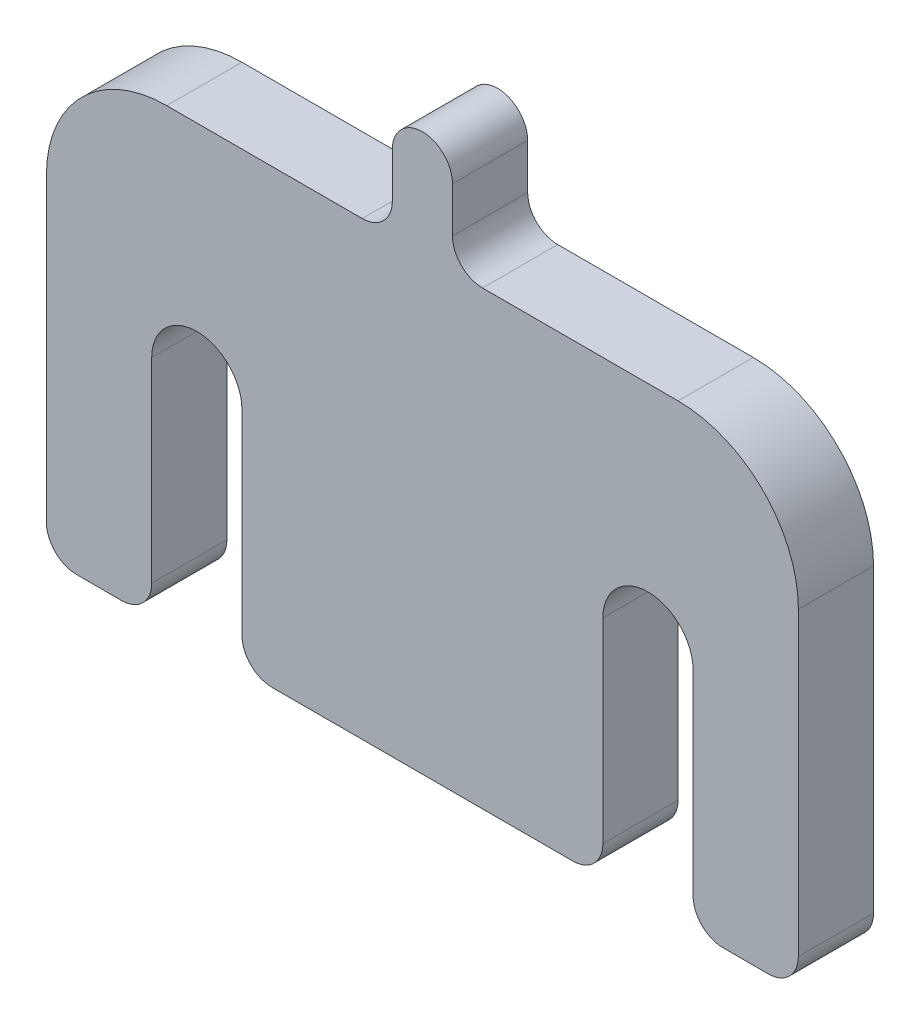
ISO-10303-21;
HEADER;
FILE_DESCRIPTION(('STEP AP214'),'2;1');
FILE_NAME('part.step','',(''),(''),'','','');
FILE_SCHEMA(('AUTOMOTIVE_DESIGN { 1 0 10303 214 1 1 1 1 }'));
ENDSEC;
DATA;
#1=APPLICATION_CONTEXT('core data for automotive mechanical design processes');
#2=APPLICATION_PROTOCOL_DEFINITION('international standard','automotive_design',2000,#1);
#3=PRODUCT_CONTEXT('',#1,'mechanical');
#4=PRODUCT('Part','Part','',(#3));
#5=PRODUCT_RELATED_PRODUCT_CATEGORY('part','',(#4));
#6=PRODUCT_DEFINITION_FORMATION('','',#4);
#7=PRODUCT_DEFINITION_CONTEXT('part definition',#1,'design');
#8=PRODUCT_DEFINITION('design','',#6,#7);
#9=PRODUCT_DEFINITION_SHAPE('','',#8);
#10=(LENGTH_UNIT() NAMED_UNIT(*) SI_UNIT(.MILLI.,.METRE.));
#11=(NAMED_UNIT(*) PLANE_ANGLE_UNIT() SI_UNIT($,.RADIAN.));
#12=(NAMED_UNIT(*) SI_UNIT($,.STERADIAN.) SOLID_ANGLE_UNIT());
#13=UNCERTAINTY_MEASURE_WITH_UNIT(LENGTH_MEASURE(1.E-05),#10,'distance_accuracy_value','');
#14=(GEOMETRIC_REPRESENTATION_CONTEXT(3) GLOBAL_UNCERTAINTY_ASSIGNED_CONTEXT((#13)) GLOBAL_UNIT_ASSIGNED_CONTEXT((#10,
#11,#12)) REPRESENTATION_CONTEXT('',''));
#15=CARTESIAN_POINT('',(0.,0.,0.));
#16=DIRECTION('',(0.,0.,1.));
#17=DIRECTION('',(1.,0.,0.));
#18=AXIS2_PLACEMENT_3D('',#15,#16,#17);
#19=CARTESIAN_POINT('',(15.,0.,5.));
#20=DIRECTION('',(0.,0.,-1.));
#21=DIRECTION('',(-1.,0.,0.));
#22=AXIS2_PLACEMENT_3D('',#19,#20,#21);
#23=CYLINDRICAL_SURFACE('',#22,3.);
#24=CARTESIAN_POINT('',(15.,0.,0.));
#25=DIRECTION('',(0.,0.,1.));
#26=DIRECTION('',(1.,0.,0.));
#27=AXIS2_PLACEMENT_3D('',#24,#25,#26);
#28=CIRCLE('',#27,3.);
#29=CARTESIAN_POINT('',(18.,0.,0.));
#30=VERTEX_POINT('',#29);
#31=CARTESIAN_POINT('',(12.,0.,0.));
#32=VERTEX_POINT('',#31);
#33=EDGE_CURVE('E215',#30,#32,#28,.T.);
#34=ORIENTED_EDGE('',*,*,#33,.F.);
#35=DIRECTION('',(0.,0.,-1.));
#36=VECTOR('',#35,1.);
#37=CARTESIAN_POINT('',(18.,0.,5.));
#38=LINE('',#37,#36);
#39=CARTESIAN_POINT('',(18.,0.,5.));
#40=VERTEX_POINT('',#39);
#41=EDGE_CURVE('E209',#40,#30,#38,.T.);
#42=ORIENTED_EDGE('',*,*,#41,.F.);
#43=CARTESIAN_POINT('',(15.,0.,5.));
#44=DIRECTION('',(0.,0.,1.));
#45=DIRECTION('',(1.,0.,0.));
#46=AXIS2_PLACEMENT_3D('',#43,#44,#45);
#47=CIRCLE('',#46,3.);
#48=CARTESIAN_POINT('',(12.,0.,5.));
#49=VERTEX_POINT('',#48);
#50=EDGE_CURVE('E212',#40,#49,#47,.T.);
#51=ORIENTED_EDGE('',*,*,#50,.T.);
#52=DIRECTION('',(0.,0.,-1.));
#53=VECTOR('',#52,1.);
#54=CARTESIAN_POINT('',(12.,0.,5.));
#55=LINE('',#54,#53);
#56=EDGE_CURVE('E270',#49,#32,#55,.T.);
#57=ORIENTED_EDGE('',*,*,#56,.T.);
#58=EDGE_LOOP('',(#34,#42,#51,#57));
#59=FACE_BOUND('',#58,.T.);
#60=ADVANCED_FACE('F36',(#59),#23,.F.);
#61=CARTESIAN_POINT('',(18.,0.,5.));
#62=DIRECTION('',(1.,0.,0.));
#63=DIRECTION('',(0.,0.,-1.));
#64=AXIS2_PLACEMENT_3D('',#61,#62,#63);
#65=PLANE('',#64);
#66=DIRECTION('',(0.,-1.,0.));
#67=VECTOR('',#66,1.);
#68=CARTESIAN_POINT('',(18.,0.,0.));
#69=LINE('',#68,#67);
#70=CARTESIAN_POINT('',(18.,-13.,0.));
#71=VERTEX_POINT('',#70);
#72=EDGE_CURVE('E272',#30,#71,#69,.T.);
#73=ORIENTED_EDGE('',*,*,#72,.T.);
#74=DIRECTION('',(0.,0.,-1.));
#75=VECTOR('',#74,1.);
#76=CARTESIAN_POINT('',(18.,-13.,5.));
#77=LINE('',#76,#75);
#78=CARTESIAN_POINT('',(18.,-13.,5.));
#79=VERTEX_POINT('',#78);
#80=EDGE_CURVE('E226',#71,#79,#77,.F.);
#81=ORIENTED_EDGE('',*,*,#80,.T.);
#82=DIRECTION('',(0.,-1.,0.));
#83=VECTOR('',#82,1.);
#84=CARTESIAN_POINT('',(18.,0.,5.));
#85=LINE('',#84,#83);
#86=EDGE_CURVE('E223',#40,#79,#85,.T.);
#87=ORIENTED_EDGE('',*,*,#86,.F.);
#88=ORIENTED_EDGE('',*,*,#41,.T.);
#89=EDGE_LOOP('',(#73,#81,#87,#88));
#90=FACE_BOUND('',#89,.T.);
#91=ADVANCED_FACE('F224',(#90),#65,.F.);
#92=CARTESIAN_POINT('',(0.,-15.,5.));
#93=DIRECTION('',(0.,-1.,0.));
#94=DIRECTION('',(1.,0.,0.));
#95=AXIS2_PLACEMENT_3D('',#92,#93,#94);
#96=PLANE('',#95);
#97=DIRECTION('',(-1.,0.,0.));
#98=VECTOR('',#97,1.);
#99=CARTESIAN_POINT('',(0.,-15.,5.));
#100=LINE('',#99,#98);
#101=CARTESIAN_POINT('',(23.,-15.,5.));
#102=VERTEX_POINT('',#101);
#103=CARTESIAN_POINT('',(20.,-15.,5.));
#104=VERTEX_POINT('',#103);
#105=EDGE_CURVE('E228',#102,#104,#100,.T.);
#106=ORIENTED_EDGE('',*,*,#105,.T.);
#107=DIRECTION('',(0.,0.,-1.));
#108=VECTOR('',#107,1.);
#109=CARTESIAN_POINT('',(20.,-15.,0.));
#110=LINE('',#109,#108);
#111=CARTESIAN_POINT('',(20.,-15.,0.));
#112=VERTEX_POINT('',#111);
#113=EDGE_CURVE('E366',#104,#112,#110,.T.);
#114=ORIENTED_EDGE('',*,*,#113,.T.);
#115=DIRECTION('',(-1.,0.,0.));
#116=VECTOR('',#115,1.);
#117=CARTESIAN_POINT('',(0.,-15.,0.));
#118=LINE('',#117,#116);
#119=CARTESIAN_POINT('',(23.,-15.,0.));
#120=VERTEX_POINT('',#119);
#121=EDGE_CURVE('E274',#120,#112,#118,.T.);
#122=ORIENTED_EDGE('',*,*,#121,.F.);
#123=DIRECTION('',(0.,0.,-1.));
#124=VECTOR('',#123,1.);
#125=CARTESIAN_POINT('',(23.,-15.,5.));
#126=LINE('',#125,#124);
#127=EDGE_CURVE('E364',#120,#102,#126,.F.);
#128=ORIENTED_EDGE('',*,*,#127,.T.);
#129=EDGE_LOOP('',(#106,#114,#122,#128));
#130=FACE_BOUND('',#129,.T.);
#131=ADVANCED_FACE('F474',(#130),#96,.T.);
#132=CARTESIAN_POINT('',(25.,0.,5.));
#133=DIRECTION('',(-1.,0.,0.));
#134=DIRECTION('',(0.,0.,1.));
#135=AXIS2_PLACEMENT_3D('',#132,#133,#134);
#136=PLANE('',#135);
#137=DIRECTION('',(0.,1.,0.));
#138=VECTOR('',#137,1.);
#139=CARTESIAN_POINT('',(25.,0.,0.));
#140=LINE('',#139,#138);
#141=CARTESIAN_POINT('',(25.,-13.,0.));
#142=VERTEX_POINT('',#141);
#143=CARTESIAN_POINT('',(25.,7.,0.));
#144=VERTEX_POINT('',#143);
#145=EDGE_CURVE('E277',#142,#144,#140,.T.);
#146=ORIENTED_EDGE('',*,*,#145,.T.);
#147=DIRECTION('',(0.,0.,-1.));
#148=VECTOR('',#147,1.);
#149=CARTESIAN_POINT('',(25.,7.,5.));
#150=LINE('',#149,#148);
#151=CARTESIAN_POINT('',(25.,7.,5.));
#152=VERTEX_POINT('',#151);
#153=EDGE_CURVE('E11',#144,#152,#150,.F.);
#154=ORIENTED_EDGE('',*,*,#153,.T.);
#155=DIRECTION('',(0.,1.,0.));
#156=VECTOR('',#155,1.);
#157=CARTESIAN_POINT('',(25.,0.,5.));
#158=LINE('',#157,#156);
#159=CARTESIAN_POINT('',(25.,-13.,5.));
#160=VERTEX_POINT('',#159);
#161=EDGE_CURVE('E245',#160,#152,#158,.T.);
#162=ORIENTED_EDGE('',*,*,#161,.F.);
#163=DIRECTION('',(0.,0.,-1.));
#164=VECTOR('',#163,1.);
#165=CARTESIAN_POINT('',(25.,-13.,0.));
#166=LINE('',#165,#164);
#167=EDGE_CURVE('E372',#160,#142,#166,.T.);
#168=ORIENTED_EDGE('',*,*,#167,.T.);
#169=EDGE_LOOP('',(#146,#154,#162,#168));
#170=FACE_BOUND('',#169,.T.);
#171=ADVANCED_FACE('F480',(#170),#136,.F.);
#172=CARTESIAN_POINT('',(0.,15.,5.));
#173=DIRECTION('',(0.,-1.,0.));
#174=DIRECTION('',(1.,0.,0.));
#175=AXIS2_PLACEMENT_3D('',#172,#173,#174);
#176=PLANE('',#175);
#177=DIRECTION('',(-1.,0.,0.));
#178=VECTOR('',#177,1.);
#179=CARTESIAN_POINT('',(0.,15.,5.));
#180=LINE('',#179,#178);
#181=CARTESIAN_POINT('',(17.,15.,5.));
#182=VERTEX_POINT('',#181);
#183=CARTESIAN_POINT('',(4.,15.,5.));
#184=VERTEX_POINT('',#183);
#185=EDGE_CURVE('E247',#182,#184,#180,.T.);
#186=ORIENTED_EDGE('',*,*,#185,.F.);
#187=DIRECTION('',(0.,0.,-1.));
#188=VECTOR('',#187,1.);
#189=CARTESIAN_POINT('',(17.,15.,5.));
#190=LINE('',#189,#188);
#191=CARTESIAN_POINT('',(17.,15.,0.));
#192=VERTEX_POINT('',#191);
#193=EDGE_CURVE('E44',#182,#192,#190,.T.);
#194=ORIENTED_EDGE('',*,*,#193,.T.);
#195=DIRECTION('',(-1.,0.,0.));
#196=VECTOR('',#195,1.);
#197=CARTESIAN_POINT('',(0.,15.,0.));
#198=LINE('',#197,#196);
#199=CARTESIAN_POINT('',(4.,15.,0.));
#200=VERTEX_POINT('',#199);
#201=EDGE_CURVE('E280',#192,#200,#198,.T.);
#202=ORIENTED_EDGE('',*,*,#201,.T.);
#203=DIRECTION('',(0.,0.,-1.));
#204=VECTOR('',#203,1.);
#205=CARTESIAN_POINT('',(4.,15.,5.));
#206=LINE('',#205,#204);
#207=EDGE_CURVE('E319',#200,#184,#206,.F.);
#208=ORIENTED_EDGE('',*,*,#207,.T.);
#209=EDGE_LOOP('',(#186,#194,#202,#208));
#210=FACE_BOUND('',#209,.T.);
#211=ADVANCED_FACE('F399',(#210),#176,.F.);
#212=CARTESIAN_POINT('',(2.,0.,5.));
#213=DIRECTION('',(1.,0.,0.));
#214=DIRECTION('',(0.,1.,0.));
#215=AXIS2_PLACEMENT_3D('',#212,#213,#214);
#216=PLANE('',#215);
#217=DIRECTION('',(0.,-1.,0.));
#218=VECTOR('',#217,1.);
#219=CARTESIAN_POINT('',(2.,0.,5.));
#220=LINE('',#219,#218);
#221=CARTESIAN_POINT('',(2.,20.,5.));
#222=VERTEX_POINT('',#221);
#223=CARTESIAN_POINT('',(2.,17.,5.));
#224=VERTEX_POINT('',#223);
#225=EDGE_CURVE('E249',#222,#224,#220,.T.);
#226=ORIENTED_EDGE('',*,*,#225,.T.);
#227=DIRECTION('',(0.,0.,-1.));
#228=VECTOR('',#227,1.);
#229=CARTESIAN_POINT('',(2.,17.,5.));
#230=LINE('',#229,#228);
#231=CARTESIAN_POINT('',(2.,17.,0.));
#232=VERTEX_POINT('',#231);
#233=EDGE_CURVE('E316',#224,#232,#230,.T.);
#234=ORIENTED_EDGE('',*,*,#233,.T.);
#235=DIRECTION('',(0.,-1.,0.));
#236=VECTOR('',#235,1.);
#237=CARTESIAN_POINT('',(2.,0.,0.));
#238=LINE('',#237,#236);
#239=CARTESIAN_POINT('',(2.,20.,0.));
#240=VERTEX_POINT('',#239);
#241=EDGE_CURVE('E282',#240,#232,#238,.T.);
#242=ORIENTED_EDGE('',*,*,#241,.F.);
#243=DIRECTION('',(0.,0.,-1.));
#244=VECTOR('',#243,1.);
#245=CARTESIAN_POINT('',(2.,20.,5.));
#246=LINE('',#245,#244);
#247=EDGE_CURVE('E220',#222,#240,#246,.T.);
#248=ORIENTED_EDGE('',*,*,#247,.F.);
#249=EDGE_LOOP('',(#226,#234,#242,#248));
#250=FACE_BOUND('',#249,.T.);
#251=ADVANCED_FACE('F413',(#250),#216,.T.);
#252=CARTESIAN_POINT('',(0.,20.,5.));
#253=DIRECTION('',(0.,0.,-1.));
#254=DIRECTION('',(-1.,0.,0.));
#255=AXIS2_PLACEMENT_3D('',#252,#253,#254);
#256=CYLINDRICAL_SURFACE('',#255,2.00000000000001);
#257=CARTESIAN_POINT('',(0.,20.,0.));
#258=DIRECTION('',(0.,0.,1.));
#259=DIRECTION('',(1.,0.,0.));
#260=AXIS2_PLACEMENT_3D('',#257,#258,#259);
#261=CIRCLE('',#260,2.00000000000001);
#262=CARTESIAN_POINT('',(-2.,20.,0.));
#263=VERTEX_POINT('',#262);
#264=EDGE_CURVE('E286',#240,#263,#261,.T.);
#265=ORIENTED_EDGE('',*,*,#264,.T.);
#266=DIRECTION('',(0.,0.,-1.));
#267=VECTOR('',#266,1.);
#268=CARTESIAN_POINT('',(-2.,20.,5.));
#269=LINE('',#268,#267);
#270=CARTESIAN_POINT('',(-2.,20.,5.));
#271=VERTEX_POINT('',#270);
#272=EDGE_CURVE('E308',#271,#263,#269,.T.);
#273=ORIENTED_EDGE('',*,*,#272,.F.);
#274=CARTESIAN_POINT('',(0.,20.,5.));
#275=DIRECTION('',(0.,0.,1.));
#276=DIRECTION('',(1.,0.,0.));
#277=AXIS2_PLACEMENT_3D('',#274,#275,#276);
#278=CIRCLE('',#277,2.00000000000001);
#279=EDGE_CURVE('E253',#222,#271,#278,.T.);
#280=ORIENTED_EDGE('',*,*,#279,.F.);
#281=ORIENTED_EDGE('',*,*,#247,.T.);
#282=EDGE_LOOP('',(#265,#273,#280,#281));
#283=FACE_BOUND('',#282,.T.);
#284=ADVANCED_FACE('F417',(#283),#256,.T.);
#285=CARTESIAN_POINT('',(-2.,0.,5.));
#286=DIRECTION('',(1.,0.,0.));
#287=DIRECTION('',(0.,1.,0.));
#288=AXIS2_PLACEMENT_3D('',#285,#286,#287);
#289=PLANE('',#288);
#290=DIRECTION('',(0.,-1.,0.));
#291=VECTOR('',#290,1.);
#292=CARTESIAN_POINT('',(-2.,0.,0.));
#293=LINE('',#292,#291);
#294=CARTESIAN_POINT('',(-2.,17.,0.));
#295=VERTEX_POINT('',#294);
#296=EDGE_CURVE('E288',#263,#295,#293,.T.);
#297=ORIENTED_EDGE('',*,*,#296,.T.);
#298=DIRECTION('',(0.,0.,-1.));
#299=VECTOR('',#298,1.);
#300=CARTESIAN_POINT('',(-2.,17.,5.));
#301=LINE('',#300,#299);
#302=CARTESIAN_POINT('',(-2.,17.,5.));
#303=VERTEX_POINT('',#302);
#304=EDGE_CURVE('E314',#295,#303,#301,.F.);
#305=ORIENTED_EDGE('',*,*,#304,.T.);
#306=DIRECTION('',(0.,-1.,0.));
#307=VECTOR('',#306,1.);
#308=CARTESIAN_POINT('',(-2.,0.,5.));
#309=LINE('',#308,#307);
#310=EDGE_CURVE('E255',#271,#303,#309,.T.);
#311=ORIENTED_EDGE('',*,*,#310,.F.);
#312=ORIENTED_EDGE('',*,*,#272,.T.);
#313=EDGE_LOOP('',(#297,#305,#311,#312));
#314=FACE_BOUND('',#313,.T.);
#315=ADVANCED_FACE('F565',(#314),#289,.F.);
#316=CARTESIAN_POINT('',(-4.,15.,0.));
#317=VERTEX_POINT('',#316);
#318=CARTESIAN_POINT('',(-17.,15.,0.));
#319=VERTEX_POINT('',#318);
#320=EDGE_CURVE('E283',#317,#319,#198,.T.);
#321=ORIENTED_EDGE('',*,*,#320,.T.);
#322=DIRECTION('',(0.,0.,-1.));
#323=VECTOR('',#322,1.);
#324=CARTESIAN_POINT('',(-17.,15.,5.));
#325=LINE('',#324,#323);
#326=CARTESIAN_POINT('',(-17.,15.,5.));
#327=VERTEX_POINT('',#326);
#328=EDGE_CURVE('E391',#319,#327,#325,.F.);
#329=ORIENTED_EDGE('',*,*,#328,.T.);
#330=CARTESIAN_POINT('',(-4.,15.,5.));
#331=VERTEX_POINT('',#330);
#332=EDGE_CURVE('E250',#331,#327,#180,.T.);
#333=ORIENTED_EDGE('',*,*,#332,.F.);
#334=DIRECTION('',(0.,0.,-1.));
#335=VECTOR('',#334,1.);
#336=CARTESIAN_POINT('',(-4.,15.,0.));
#337=LINE('',#336,#335);
#338=EDGE_CURVE('E219',#331,#317,#337,.T.);
#339=ORIENTED_EDGE('',*,*,#338,.T.);
#340=EDGE_LOOP('',(#321,#329,#333,#339));
#341=FACE_BOUND('',#340,.T.);
#342=ADVANCED_FACE('F429',(#341),#176,.F.);
#343=CARTESIAN_POINT('',(-25.,0.,5.));
#344=DIRECTION('',(-1.,0.,0.));
#345=DIRECTION('',(0.,0.,1.));
#346=AXIS2_PLACEMENT_3D('',#343,#344,#345);
#347=PLANE('',#346);
#348=DIRECTION('',(0.,1.,0.));
#349=VECTOR('',#348,1.);
#350=CARTESIAN_POINT('',(-25.,0.,5.));
#351=LINE('',#350,#349);
#352=CARTESIAN_POINT('',(-25.,-13.,5.));
#353=VERTEX_POINT('',#352);
#354=CARTESIAN_POINT('',(-25.,6.99999999999999,5.));
#355=VERTEX_POINT('',#354);
#356=EDGE_CURVE('E258',#353,#355,#351,.T.);
#357=ORIENTED_EDGE('',*,*,#356,.T.);
#358=DIRECTION('',(0.,0.,-1.));
#359=VECTOR('',#358,1.);
#360=CARTESIAN_POINT('',(-25.,6.99999999999999,0.));
#361=LINE('',#360,#359);
#362=CARTESIAN_POINT('',(-25.,6.99999999999999,0.));
#363=VERTEX_POINT('',#362);
#364=EDGE_CURVE('E384',#355,#363,#361,.T.);
#365=ORIENTED_EDGE('',*,*,#364,.T.);
#366=DIRECTION('',(0.,1.,0.));
#367=VECTOR('',#366,1.);
#368=CARTESIAN_POINT('',(-25.,0.,0.));
#369=LINE('',#368,#367);
#370=CARTESIAN_POINT('',(-25.,-13.,0.));
#371=VERTEX_POINT('',#370);
#372=EDGE_CURVE('E291',#371,#363,#369,.T.);
#373=ORIENTED_EDGE('',*,*,#372,.F.);
#374=DIRECTION('',(0.,0.,-1.));
#375=VECTOR('',#374,1.);
#376=CARTESIAN_POINT('',(-25.,-13.,5.));
#377=LINE('',#376,#375);
#378=EDGE_CURVE('E370',#371,#353,#377,.F.);
#379=ORIENTED_EDGE('',*,*,#378,.T.);
#380=EDGE_LOOP('',(#357,#365,#373,#379));
#381=FACE_BOUND('',#380,.T.);
#382=ADVANCED_FACE('F438',(#381),#347,.T.);
#383=CARTESIAN_POINT('',(-20.,-15.,0.));
#384=VERTEX_POINT('',#383);
#385=CARTESIAN_POINT('',(-23.,-15.,0.));
#386=VERTEX_POINT('',#385);
#387=EDGE_CURVE('E278',#384,#386,#118,.T.);
#388=ORIENTED_EDGE('',*,*,#387,.F.);
#389=DIRECTION('',(0.,0.,-1.));
#390=VECTOR('',#389,1.);
#391=CARTESIAN_POINT('',(-20.,-15.,5.));
#392=LINE('',#391,#390);
#393=CARTESIAN_POINT('',(-20.,-15.,5.));
#394=VERTEX_POINT('',#393);
#395=EDGE_CURVE('E340',#384,#394,#392,.F.);
#396=ORIENTED_EDGE('',*,*,#395,.T.);
#397=CARTESIAN_POINT('',(-23.,-15.,5.));
#398=VERTEX_POINT('',#397);
#399=EDGE_CURVE('E244',#394,#398,#100,.T.);
#400=ORIENTED_EDGE('',*,*,#399,.T.);
#401=DIRECTION('',(0.,0.,-1.));
#402=VECTOR('',#401,1.);
#403=CARTESIAN_POINT('',(-23.,-15.,5.));
#404=LINE('',#403,#402);
#405=EDGE_CURVE('E337',#398,#386,#404,.T.);
#406=ORIENTED_EDGE('',*,*,#405,.T.);
#407=EDGE_LOOP('',(#388,#396,#400,#406));
#408=FACE_BOUND('',#407,.T.);
#409=ADVANCED_FACE('F450',(#408),#96,.T.);
#410=CARTESIAN_POINT('',(-18.,0.,5.));
#411=DIRECTION('',(1.,0.,0.));
#412=DIRECTION('',(0.,1.,0.));
#413=AXIS2_PLACEMENT_3D('',#410,#411,#412);
#414=PLANE('',#413);
#415=DIRECTION('',(0.,-1.,0.));
#416=VECTOR('',#415,1.);
#417=CARTESIAN_POINT('',(-18.,0.,5.));
#418=LINE('',#417,#416);
#419=CARTESIAN_POINT('',(-18.,0.,5.));
#420=VERTEX_POINT('',#419);
#421=CARTESIAN_POINT('',(-18.,-13.,5.));
#422=VERTEX_POINT('',#421);
#423=EDGE_CURVE('E261',#420,#422,#418,.T.);
#424=ORIENTED_EDGE('',*,*,#423,.T.);
#425=DIRECTION('',(0.,0.,-1.));
#426=VECTOR('',#425,1.);
#427=CARTESIAN_POINT('',(-18.,-13.,5.));
#428=LINE('',#427,#426);
#429=CARTESIAN_POINT('',(-18.,-13.,0.));
#430=VERTEX_POINT('',#429);
#431=EDGE_CURVE('E322',#422,#430,#428,.T.);
#432=ORIENTED_EDGE('',*,*,#431,.T.);
#433=DIRECTION('',(0.,-1.,0.));
#434=VECTOR('',#433,1.);
#435=CARTESIAN_POINT('',(-18.,0.,0.));
#436=LINE('',#435,#434);
#437=CARTESIAN_POINT('',(-18.,0.,0.));
#438=VERTEX_POINT('',#437);
#439=EDGE_CURVE('E294',#438,#430,#436,.T.);
#440=ORIENTED_EDGE('',*,*,#439,.F.);
#441=DIRECTION('',(0.,0.,-1.));
#442=VECTOR('',#441,1.);
#443=CARTESIAN_POINT('',(-18.,0.,5.));
#444=LINE('',#443,#442);
#445=EDGE_CURVE('E306',#420,#438,#444,.T.);
#446=ORIENTED_EDGE('',*,*,#445,.F.);
#447=EDGE_LOOP('',(#424,#432,#440,#446));
#448=FACE_BOUND('',#447,.T.);
#449=ADVANCED_FACE('F607',(#448),#414,.T.);
#450=CARTESIAN_POINT('',(-15.,0.,5.));
#451=DIRECTION('',(0.,0.,-1.));
#452=DIRECTION('',(-1.,0.,0.));
#453=AXIS2_PLACEMENT_3D('',#450,#451,#452);
#454=CYLINDRICAL_SURFACE('',#453,3.);
#455=CARTESIAN_POINT('',(-15.,0.,0.));
#456=DIRECTION('',(0.,0.,1.));
#457=DIRECTION('',(1.,0.,0.));
#458=AXIS2_PLACEMENT_3D('',#455,#456,#457);
#459=CIRCLE('',#458,3.);
#460=CARTESIAN_POINT('',(-12.,0.,0.));
#461=VERTEX_POINT('',#460);
#462=EDGE_CURVE('E297',#461,#438,#459,.T.);
#463=ORIENTED_EDGE('',*,*,#462,.F.);
#464=DIRECTION('',(0.,0.,-1.));
#465=VECTOR('',#464,1.);
#466=CARTESIAN_POINT('',(-12.,0.,5.));
#467=LINE('',#466,#465);
#468=CARTESIAN_POINT('',(-12.,0.,5.));
#469=VERTEX_POINT('',#468);
#470=EDGE_CURVE('E304',#469,#461,#467,.T.);
#471=ORIENTED_EDGE('',*,*,#470,.F.);
#472=CARTESIAN_POINT('',(-15.,0.,5.));
#473=DIRECTION('',(0.,0.,1.));
#474=DIRECTION('',(1.,0.,0.));
#475=AXIS2_PLACEMENT_3D('',#472,#473,#474);
#476=CIRCLE('',#475,3.);
#477=EDGE_CURVE('E264',#469,#420,#476,.T.);
#478=ORIENTED_EDGE('',*,*,#477,.T.);
#479=ORIENTED_EDGE('',*,*,#445,.T.);
#480=EDGE_LOOP('',(#463,#471,#478,#479));
#481=FACE_BOUND('',#480,.T.);
#482=ADVANCED_FACE('F601',(#481),#454,.F.);
#483=CARTESIAN_POINT('',(-12.,0.,5.));
#484=DIRECTION('',(1.,0.,0.));
#485=DIRECTION('',(0.,1.,0.));
#486=AXIS2_PLACEMENT_3D('',#483,#484,#485);
#487=PLANE('',#486);
#488=DIRECTION('',(0.,-1.,0.));
#489=VECTOR('',#488,1.);
#490=CARTESIAN_POINT('',(-12.,0.,0.));
#491=LINE('',#490,#489);
#492=CARTESIAN_POINT('',(-12.,-13.,0.));
#493=VERTEX_POINT('',#492);
#494=EDGE_CURVE('E300',#461,#493,#491,.T.);
#495=ORIENTED_EDGE('',*,*,#494,.T.);
#496=DIRECTION('',(0.,0.,-1.));
#497=VECTOR('',#496,1.);
#498=CARTESIAN_POINT('',(-12.,-13.,5.));
#499=LINE('',#498,#497);
#500=CARTESIAN_POINT('',(-12.,-13.,5.));
#501=VERTEX_POINT('',#500);
#502=EDGE_CURVE('E359',#493,#501,#499,.F.);
#503=ORIENTED_EDGE('',*,*,#502,.T.);
#504=DIRECTION('',(0.,-1.,0.));
#505=VECTOR('',#504,1.);
#506=CARTESIAN_POINT('',(-12.,0.,5.));
#507=LINE('',#506,#505);
#508=EDGE_CURVE('E243',#469,#501,#507,.T.);
#509=ORIENTED_EDGE('',*,*,#508,.F.);
#510=ORIENTED_EDGE('',*,*,#470,.T.);
#511=EDGE_LOOP('',(#495,#503,#509,#510));
#512=FACE_BOUND('',#511,.T.);
#513=ADVANCED_FACE('F606',(#512),#487,.F.);
#514=CARTESIAN_POINT('',(10.,-15.,5.));
#515=VERTEX_POINT('',#514);
#516=CARTESIAN_POINT('',(-10.,-15.,5.));
#517=VERTEX_POINT('',#516);
#518=EDGE_CURVE('E240',#515,#517,#100,.T.);
#519=ORIENTED_EDGE('',*,*,#518,.T.);
#520=DIRECTION('',(0.,0.,-1.));
#521=VECTOR('',#520,1.);
#522=CARTESIAN_POINT('',(-10.,-15.,0.));
#523=LINE('',#522,#521);
#524=CARTESIAN_POINT('',(-10.,-15.,0.));
#525=VERTEX_POINT('',#524);
#526=EDGE_CURVE('E356',#517,#525,#523,.T.);
#527=ORIENTED_EDGE('',*,*,#526,.T.);
#528=CARTESIAN_POINT('',(10.,-15.,0.));
#529=VERTEX_POINT('',#528);
#530=EDGE_CURVE('E237',#529,#525,#118,.T.);
#531=ORIENTED_EDGE('',*,*,#530,.F.);
#532=DIRECTION('',(0.,0.,-1.));
#533=VECTOR('',#532,1.);
#534=CARTESIAN_POINT('',(10.,-15.,5.));
#535=LINE('',#534,#533);
#536=EDGE_CURVE('E354',#529,#515,#535,.F.);
#537=ORIENTED_EDGE('',*,*,#536,.T.);
#538=EDGE_LOOP('',(#519,#527,#531,#537));
#539=FACE_BOUND('',#538,.T.);
#540=ADVANCED_FACE('F457',(#539),#96,.T.);
#541=CARTESIAN_POINT('',(12.,0.,5.));
#542=DIRECTION('',(1.,0.,0.));
#543=DIRECTION('',(0.,1.,0.));
#544=AXIS2_PLACEMENT_3D('',#541,#542,#543);
#545=PLANE('',#544);
#546=DIRECTION('',(0.,-1.,0.));
#547=VECTOR('',#546,1.);
#548=CARTESIAN_POINT('',(12.,0.,5.));
#549=LINE('',#548,#547);
#550=CARTESIAN_POINT('',(12.,-13.,5.));
#551=VERTEX_POINT('',#550);
#552=EDGE_CURVE('E233',#49,#551,#549,.T.);
#553=ORIENTED_EDGE('',*,*,#552,.T.);
#554=DIRECTION('',(0.,0.,-1.));
#555=VECTOR('',#554,1.);
#556=CARTESIAN_POINT('',(12.,-13.,5.));
#557=LINE('',#556,#555);
#558=CARTESIAN_POINT('',(12.,-13.,0.));
#559=VERTEX_POINT('',#558);
#560=EDGE_CURVE('E361',#551,#559,#557,.T.);
#561=ORIENTED_EDGE('',*,*,#560,.T.);
#562=DIRECTION('',(0.,-1.,0.));
#563=VECTOR('',#562,1.);
#564=CARTESIAN_POINT('',(12.,0.,0.));
#565=LINE('',#564,#563);
#566=EDGE_CURVE('E234',#32,#559,#565,.T.);
#567=ORIENTED_EDGE('',*,*,#566,.F.);
#568=ORIENTED_EDGE('',*,*,#56,.F.);
#569=EDGE_LOOP('',(#553,#561,#567,#568));
#570=FACE_BOUND('',#569,.T.);
#571=ADVANCED_FACE('F465',(#570),#545,.T.);
#572=CARTESIAN_POINT('',(0.,0.,5.));
#573=DIRECTION('',(0.,0.,1.));
#574=DIRECTION('',(1.,0.,0.));
#575=AXIS2_PLACEMENT_3D('',#572,#573,#574);
#576=PLANE('',#575);
#577=ORIENTED_EDGE('',*,*,#332,.T.);
#578=CARTESIAN_POINT('',(-17.,6.99999999999999,5.));
#579=DIRECTION('',(0.,0.,1.));
#580=DIRECTION('',(1.,0.,0.));
#581=AXIS2_PLACEMENT_3D('',#578,#579,#580);
#582=CIRCLE('',#581,8.);
#583=EDGE_CURVE('E394',#327,#355,#582,.T.);
#584=ORIENTED_EDGE('',*,*,#583,.T.);
#585=ORIENTED_EDGE('',*,*,#356,.F.);
#586=CARTESIAN_POINT('',(-23.,-13.,5.));
#587=DIRECTION('',(0.,0.,1.));
#588=DIRECTION('',(1.,0.,0.));
#589=AXIS2_PLACEMENT_3D('',#586,#587,#588);
#590=CIRCLE('',#589,2.);
#591=EDGE_CURVE('E344',#353,#398,#590,.T.);
#592=ORIENTED_EDGE('',*,*,#591,.T.);
#593=ORIENTED_EDGE('',*,*,#399,.F.);
#594=CARTESIAN_POINT('',(-20.,-13.,5.));
#595=DIRECTION('',(0.,0.,1.));
#596=DIRECTION('',(1.,0.,0.));
#597=AXIS2_PLACEMENT_3D('',#594,#595,#596);
#598=CIRCLE('',#597,2.);
#599=EDGE_CURVE('E352',#394,#422,#598,.T.);
#600=ORIENTED_EDGE('',*,*,#599,.T.);
#601=ORIENTED_EDGE('',*,*,#423,.F.);
#602=ORIENTED_EDGE('',*,*,#477,.F.);
#603=ORIENTED_EDGE('',*,*,#508,.T.);
#604=CARTESIAN_POINT('',(-10.,-13.,5.));
#605=DIRECTION('',(0.,0.,1.));
#606=DIRECTION('',(1.,0.,0.));
#607=AXIS2_PLACEMENT_3D('',#604,#605,#606);
#608=CIRCLE('',#607,2.);
#609=EDGE_CURVE('E350',#501,#517,#608,.T.);
#610=ORIENTED_EDGE('',*,*,#609,.T.);
#611=ORIENTED_EDGE('',*,*,#518,.F.);
#612=CARTESIAN_POINT('',(10.,-13.,5.));
#613=DIRECTION('',(0.,0.,1.));
#614=DIRECTION('',(1.,0.,0.));
#615=AXIS2_PLACEMENT_3D('',#612,#613,#614);
#616=CIRCLE('',#615,2.);
#617=EDGE_CURVE('E348',#515,#551,#616,.T.);
#618=ORIENTED_EDGE('',*,*,#617,.T.);
#619=ORIENTED_EDGE('',*,*,#552,.F.);
#620=ORIENTED_EDGE('',*,*,#50,.F.);
#621=ORIENTED_EDGE('',*,*,#86,.T.);
#622=CARTESIAN_POINT('',(20.,-13.,5.));
#623=DIRECTION('',(0.,0.,1.));
#624=DIRECTION('',(1.,0.,0.));
#625=AXIS2_PLACEMENT_3D('',#622,#623,#624);
#626=CIRCLE('',#625,2.);
#627=EDGE_CURVE('E346',#79,#104,#626,.T.);
#628=ORIENTED_EDGE('',*,*,#627,.T.);
#629=ORIENTED_EDGE('',*,*,#105,.F.);
#630=CARTESIAN_POINT('',(23.,-13.,5.));
#631=DIRECTION('',(0.,0.,1.));
#632=DIRECTION('',(1.,0.,0.));
#633=AXIS2_PLACEMENT_3D('',#630,#631,#632);
#634=CIRCLE('',#633,2.);
#635=EDGE_CURVE('E342',#102,#160,#634,.T.);
#636=ORIENTED_EDGE('',*,*,#635,.T.);
#637=ORIENTED_EDGE('',*,*,#161,.T.);
#638=CARTESIAN_POINT('',(17.,7.,5.));
#639=DIRECTION('',(0.,0.,1.));
#640=DIRECTION('',(1.,0.,0.));
#641=AXIS2_PLACEMENT_3D('',#638,#639,#640);
#642=CIRCLE('',#641,8.);
#643=EDGE_CURVE('E51',#152,#182,#642,.T.);
#644=ORIENTED_EDGE('',*,*,#643,.T.);
#645=ORIENTED_EDGE('',*,*,#185,.T.);
#646=CARTESIAN_POINT('',(4.,17.,5.));
#647=DIRECTION('',(0.,0.,1.));
#648=DIRECTION('',(1.,0.,0.));
#649=AXIS2_PLACEMENT_3D('',#646,#647,#648);
#650=CIRCLE('',#649,2.);
#651=EDGE_CURVE('E382',#184,#224,#650,.F.);
#652=ORIENTED_EDGE('',*,*,#651,.T.);
#653=ORIENTED_EDGE('',*,*,#225,.F.);
#654=ORIENTED_EDGE('',*,*,#279,.T.);
#655=ORIENTED_EDGE('',*,*,#310,.T.);
#656=CARTESIAN_POINT('',(-4.,17.,5.));
#657=DIRECTION('',(0.,0.,1.));
#658=DIRECTION('',(1.,0.,0.));
#659=AXIS2_PLACEMENT_3D('',#656,#657,#658);
#660=CIRCLE('',#659,2.);
#661=EDGE_CURVE('E377',#303,#331,#660,.F.);
#662=ORIENTED_EDGE('',*,*,#661,.T.);
#663=EDGE_LOOP('',(#577,#584,#585,#592,#593,#600,#601,#602,#603,#610,#611,#618,#619,#620,#621,
#628,#629,#636,#637,#644,#645,#652,#653,#654,#655,#662));
#664=FACE_BOUND('',#663,.T.);
#665=ADVANCED_FACE('F231',(#664),#576,.T.);
#666=CARTESIAN_POINT('',(0.,0.,0.));
#667=DIRECTION('',(0.,0.,1.));
#668=DIRECTION('',(1.,0.,0.));
#669=AXIS2_PLACEMENT_3D('',#666,#667,#668);
#670=PLANE('',#669);
#671=ORIENTED_EDGE('',*,*,#372,.T.);
#672=CARTESIAN_POINT('',(-17.,6.99999999999999,0.));
#673=DIRECTION('',(0.,0.,1.));
#674=DIRECTION('',(1.,0.,0.));
#675=AXIS2_PLACEMENT_3D('',#672,#673,#674);
#676=CIRCLE('',#675,8.);
#677=EDGE_CURVE('E389',#363,#319,#676,.F.);
#678=ORIENTED_EDGE('',*,*,#677,.T.);
#679=ORIENTED_EDGE('',*,*,#320,.F.);
#680=CARTESIAN_POINT('',(-4.,17.,0.));
#681=DIRECTION('',(0.,0.,1.));
#682=DIRECTION('',(1.,0.,0.));
#683=AXIS2_PLACEMENT_3D('',#680,#681,#682);
#684=CIRCLE('',#683,2.);
#685=EDGE_CURVE('E375',#317,#295,#684,.T.);
#686=ORIENTED_EDGE('',*,*,#685,.T.);
#687=ORIENTED_EDGE('',*,*,#296,.F.);
#688=ORIENTED_EDGE('',*,*,#264,.F.);
#689=ORIENTED_EDGE('',*,*,#241,.T.);
#690=CARTESIAN_POINT('',(4.,17.,0.));
#691=DIRECTION('',(0.,0.,1.));
#692=DIRECTION('',(1.,0.,0.));
#693=AXIS2_PLACEMENT_3D('',#690,#691,#692);
#694=CIRCLE('',#693,2.);
#695=EDGE_CURVE('E379',#232,#200,#694,.T.);
#696=ORIENTED_EDGE('',*,*,#695,.T.);
#697=ORIENTED_EDGE('',*,*,#201,.F.);
#698=CARTESIAN_POINT('',(17.,7.,0.));
#699=DIRECTION('',(0.,0.,1.));
#700=DIRECTION('',(1.,0.,0.));
#701=AXIS2_PLACEMENT_3D('',#698,#699,#700);
#702=CIRCLE('',#701,8.);
#703=EDGE_CURVE('E387',#192,#144,#702,.F.);
#704=ORIENTED_EDGE('',*,*,#703,.T.);
#705=ORIENTED_EDGE('',*,*,#145,.F.);
#706=CARTESIAN_POINT('',(23.,-13.,0.));
#707=DIRECTION('',(0.,0.,1.));
#708=DIRECTION('',(1.,0.,0.));
#709=AXIS2_PLACEMENT_3D('',#706,#707,#708);
#710=CIRCLE('',#709,2.);
#711=EDGE_CURVE('E325',#142,#120,#710,.F.);
#712=ORIENTED_EDGE('',*,*,#711,.T.);
#713=ORIENTED_EDGE('',*,*,#121,.T.);
#714=CARTESIAN_POINT('',(20.,-13.,0.));
#715=DIRECTION('',(0.,0.,1.));
#716=DIRECTION('',(1.,0.,0.));
#717=AXIS2_PLACEMENT_3D('',#714,#715,#716);
#718=CIRCLE('',#717,2.);
#719=EDGE_CURVE('E329',#112,#71,#718,.F.);
#720=ORIENTED_EDGE('',*,*,#719,.T.);
#721=ORIENTED_EDGE('',*,*,#72,.F.);
#722=ORIENTED_EDGE('',*,*,#33,.T.);
#723=ORIENTED_EDGE('',*,*,#566,.T.);
#724=CARTESIAN_POINT('',(10.,-13.,0.));
#725=DIRECTION('',(0.,0.,1.));
#726=DIRECTION('',(1.,0.,0.));
#727=AXIS2_PLACEMENT_3D('',#724,#725,#726);
#728=CIRCLE('',#727,2.);
#729=EDGE_CURVE('E331',#559,#529,#728,.F.);
#730=ORIENTED_EDGE('',*,*,#729,.T.);
#731=ORIENTED_EDGE('',*,*,#530,.T.);
#732=CARTESIAN_POINT('',(-10.,-13.,0.));
#733=DIRECTION('',(0.,0.,1.));
#734=DIRECTION('',(1.,0.,0.));
#735=AXIS2_PLACEMENT_3D('',#732,#733,#734);
#736=CIRCLE('',#735,2.);
#737=EDGE_CURVE('E333',#525,#493,#736,.F.);
#738=ORIENTED_EDGE('',*,*,#737,.T.);
#739=ORIENTED_EDGE('',*,*,#494,.F.);
#740=ORIENTED_EDGE('',*,*,#462,.T.);
#741=ORIENTED_EDGE('',*,*,#439,.T.);
#742=CARTESIAN_POINT('',(-20.,-13.,0.));
#743=DIRECTION('',(0.,0.,1.));
#744=DIRECTION('',(1.,0.,0.));
#745=AXIS2_PLACEMENT_3D('',#742,#743,#744);
#746=CIRCLE('',#745,2.);
#747=EDGE_CURVE('E335',#430,#384,#746,.F.);
#748=ORIENTED_EDGE('',*,*,#747,.T.);
#749=ORIENTED_EDGE('',*,*,#387,.T.);
#750=CARTESIAN_POINT('',(-23.,-13.,0.));
#751=DIRECTION('',(0.,0.,1.));
#752=DIRECTION('',(1.,0.,0.));
#753=AXIS2_PLACEMENT_3D('',#750,#751,#752);
#754=CIRCLE('',#753,2.);
#755=EDGE_CURVE('E327',#386,#371,#754,.F.);
#756=ORIENTED_EDGE('',*,*,#755,.T.);
#757=EDGE_LOOP('',(#671,#678,#679,#686,#687,#688,#689,#696,#697,#704,#705,#712,#713,#720,#721,
#722,#723,#730,#731,#738,#739,#740,#741,#748,#749,#756));
#758=FACE_BOUND('',#757,.T.);
#759=ADVANCED_FACE('F402',(#758),#670,.F.);
#760=CARTESIAN_POINT('',(-4.,17.,5.));
#761=DIRECTION('',(0.,0.,1.));
#762=DIRECTION('',(1.,0.,0.));
#763=AXIS2_PLACEMENT_3D('',#760,#761,#762);
#764=CYLINDRICAL_SURFACE('',#763,2.);
#765=ORIENTED_EDGE('',*,*,#661,.F.);
#766=ORIENTED_EDGE('',*,*,#304,.F.);
#767=ORIENTED_EDGE('',*,*,#685,.F.);
#768=ORIENTED_EDGE('',*,*,#338,.F.);
#769=EDGE_LOOP('',(#765,#766,#767,#768));
#770=FACE_BOUND('',#769,.T.);
#771=ADVANCED_FACE('F425',(#770),#764,.F.);
#772=CARTESIAN_POINT('',(4.,17.,5.));
#773=DIRECTION('',(0.,0.,-1.));
#774=DIRECTION('',(-1.,0.,0.));
#775=AXIS2_PLACEMENT_3D('',#772,#773,#774);
#776=CYLINDRICAL_SURFACE('',#775,2.);
#777=ORIENTED_EDGE('',*,*,#651,.F.);
#778=ORIENTED_EDGE('',*,*,#207,.F.);
#779=ORIENTED_EDGE('',*,*,#695,.F.);
#780=ORIENTED_EDGE('',*,*,#233,.F.);
#781=EDGE_LOOP('',(#777,#778,#779,#780));
#782=FACE_BOUND('',#781,.T.);
#783=ADVANCED_FACE('F410',(#782),#776,.F.);
#784=CARTESIAN_POINT('',(-20.,-13.,5.));
#785=DIRECTION('',(0.,0.,-1.));
#786=DIRECTION('',(-1.,0.,0.));
#787=AXIS2_PLACEMENT_3D('',#784,#785,#786);
#788=CYLINDRICAL_SURFACE('',#787,2.);
#789=ORIENTED_EDGE('',*,*,#599,.F.);
#790=ORIENTED_EDGE('',*,*,#395,.F.);
#791=ORIENTED_EDGE('',*,*,#747,.F.);
#792=ORIENTED_EDGE('',*,*,#431,.F.);
#793=EDGE_LOOP('',(#789,#790,#791,#792));
#794=FACE_BOUND('',#793,.T.);
#795=ADVANCED_FACE('F497',(#794),#788,.T.);
#796=CARTESIAN_POINT('',(-10.,-13.,5.));
#797=DIRECTION('',(0.,0.,1.));
#798=DIRECTION('',(1.,0.,0.));
#799=AXIS2_PLACEMENT_3D('',#796,#797,#798);
#800=CYLINDRICAL_SURFACE('',#799,2.);
#801=ORIENTED_EDGE('',*,*,#609,.F.);
#802=ORIENTED_EDGE('',*,*,#502,.F.);
#803=ORIENTED_EDGE('',*,*,#737,.F.);
#804=ORIENTED_EDGE('',*,*,#526,.F.);
#805=EDGE_LOOP('',(#801,#802,#803,#804));
#806=FACE_BOUND('',#805,.T.);
#807=ADVANCED_FACE('F500',(#806),#800,.T.);
#808=CARTESIAN_POINT('',(10.,-13.,5.));
#809=DIRECTION('',(0.,0.,-1.));
#810=DIRECTION('',(-1.,0.,0.));
#811=AXIS2_PLACEMENT_3D('',#808,#809,#810);
#812=CYLINDRICAL_SURFACE('',#811,2.);
#813=ORIENTED_EDGE('',*,*,#617,.F.);
#814=ORIENTED_EDGE('',*,*,#536,.F.);
#815=ORIENTED_EDGE('',*,*,#729,.F.);
#816=ORIENTED_EDGE('',*,*,#560,.F.);
#817=EDGE_LOOP('',(#813,#814,#815,#816));
#818=FACE_BOUND('',#817,.T.);
#819=ADVANCED_FACE('F462',(#818),#812,.T.);
#820=CARTESIAN_POINT('',(20.,-13.,5.));
#821=DIRECTION('',(0.,0.,1.));
#822=DIRECTION('',(1.,0.,0.));
#823=AXIS2_PLACEMENT_3D('',#820,#821,#822);
#824=CYLINDRICAL_SURFACE('',#823,2.);
#825=ORIENTED_EDGE('',*,*,#627,.F.);
#826=ORIENTED_EDGE('',*,*,#80,.F.);
#827=ORIENTED_EDGE('',*,*,#719,.F.);
#828=ORIENTED_EDGE('',*,*,#113,.F.);
#829=EDGE_LOOP('',(#825,#826,#827,#828));
#830=FACE_BOUND('',#829,.T.);
#831=ADVANCED_FACE('F468',(#830),#824,.T.);
#832=CARTESIAN_POINT('',(-23.,-13.,5.));
#833=DIRECTION('',(0.,0.,-1.));
#834=DIRECTION('',(-1.,0.,0.));
#835=AXIS2_PLACEMENT_3D('',#832,#833,#834);
#836=CYLINDRICAL_SURFACE('',#835,2.);
#837=ORIENTED_EDGE('',*,*,#591,.F.);
#838=ORIENTED_EDGE('',*,*,#378,.F.);
#839=ORIENTED_EDGE('',*,*,#755,.F.);
#840=ORIENTED_EDGE('',*,*,#405,.F.);
#841=EDGE_LOOP('',(#837,#838,#839,#840));
#842=FACE_BOUND('',#841,.T.);
#843=ADVANCED_FACE('F446',(#842),#836,.T.);
#844=CARTESIAN_POINT('',(23.,-13.,5.));
#845=DIRECTION('',(0.,0.,1.));
#846=DIRECTION('',(1.,0.,0.));
#847=AXIS2_PLACEMENT_3D('',#844,#845,#846);
#848=CYLINDRICAL_SURFACE('',#847,2.);
#849=ORIENTED_EDGE('',*,*,#635,.F.);
#850=ORIENTED_EDGE('',*,*,#127,.F.);
#851=ORIENTED_EDGE('',*,*,#711,.F.);
#852=ORIENTED_EDGE('',*,*,#167,.F.);
#853=EDGE_LOOP('',(#849,#850,#851,#852));
#854=FACE_BOUND('',#853,.T.);
#855=ADVANCED_FACE('F478',(#854),#848,.T.);
#856=CARTESIAN_POINT('',(-17.,6.99999999999999,5.));
#857=DIRECTION('',(0.,0.,1.));
#858=DIRECTION('',(1.,0.,0.));
#859=AXIS2_PLACEMENT_3D('',#856,#857,#858);
#860=CYLINDRICAL_SURFACE('',#859,8.);
#861=ORIENTED_EDGE('',*,*,#583,.F.);
#862=ORIENTED_EDGE('',*,*,#328,.F.);
#863=ORIENTED_EDGE('',*,*,#677,.F.);
#864=ORIENTED_EDGE('',*,*,#364,.F.);
#865=EDGE_LOOP('',(#861,#862,#863,#864));
#866=FACE_BOUND('',#865,.T.);
#867=ADVANCED_FACE('F436',(#866),#860,.T.);
#868=CARTESIAN_POINT('',(17.,7.,5.));
#869=DIRECTION('',(0.,0.,-1.));
#870=DIRECTION('',(-1.,0.,0.));
#871=AXIS2_PLACEMENT_3D('',#868,#869,#870);
#872=CYLINDRICAL_SURFACE('',#871,8.);
#873=ORIENTED_EDGE('',*,*,#643,.F.);
#874=ORIENTED_EDGE('',*,*,#153,.F.);
#875=ORIENTED_EDGE('',*,*,#703,.F.);
#876=ORIENTED_EDGE('',*,*,#193,.F.);
#877=EDGE_LOOP('',(#873,#874,#875,#876));
#878=FACE_BOUND('',#877,.T.);
#879=ADVANCED_FACE('F38',(#878),#872,.T.);
#880=CLOSED_SHELL('',(#60,#91,#131,#171,#211,#251,#284,#315,#342,#382,#409,#449,#482,#513,#540,
#571,#665,#759,#771,#783,#795,#807,#819,#831,#843,#855,#867,#879));
#881=MANIFOLD_SOLID_BREP('B2',#880);
#882=ADVANCED_BREP_SHAPE_REPRESENTATION('',(#18,#881),#14);
#883=SHAPE_DEFINITION_REPRESENTATION(#9,#882);
ENDSEC;
END-ISO-10303-21;
